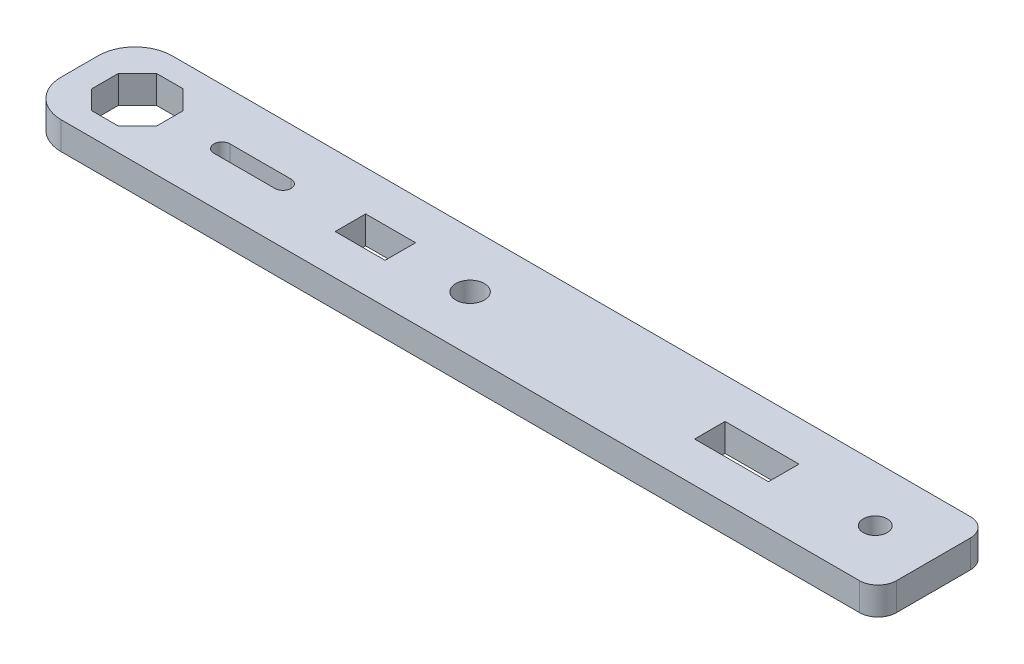
ISO-10303-21;
HEADER;
FILE_DESCRIPTION(('STEP AP214'),'2;1');
FILE_NAME('part.step','',(''),(''),'','','');
FILE_SCHEMA(('AUTOMOTIVE_DESIGN { 1 0 10303 214 1 1 1 1 }'));
ENDSEC;
DATA;
#1=APPLICATION_CONTEXT('core data for automotive mechanical design processes');
#2=APPLICATION_PROTOCOL_DEFINITION('international standard','automotive_design',2000,#1);
#3=PRODUCT_CONTEXT('',#1,'mechanical');
#4=PRODUCT('Part','Part','',(#3));
#5=PRODUCT_RELATED_PRODUCT_CATEGORY('part','',(#4));
#6=PRODUCT_DEFINITION_FORMATION('','',#4);
#7=PRODUCT_DEFINITION_CONTEXT('part definition',#1,'design');
#8=PRODUCT_DEFINITION('design','',#6,#7);
#9=PRODUCT_DEFINITION_SHAPE('','',#8);
#10=(LENGTH_UNIT() NAMED_UNIT(*) SI_UNIT(.MILLI.,.METRE.));
#11=(NAMED_UNIT(*) PLANE_ANGLE_UNIT() SI_UNIT($,.RADIAN.));
#12=(NAMED_UNIT(*) SI_UNIT($,.STERADIAN.) SOLID_ANGLE_UNIT());
#13=UNCERTAINTY_MEASURE_WITH_UNIT(LENGTH_MEASURE(1.E-05),#10,'distance_accuracy_value','');
#14=(GEOMETRIC_REPRESENTATION_CONTEXT(3) GLOBAL_UNCERTAINTY_ASSIGNED_CONTEXT((#13)) GLOBAL_UNIT_ASSIGNED_CONTEXT((#10,
#11,#12)) REPRESENTATION_CONTEXT('',''));
#15=CARTESIAN_POINT('',(0.,0.,0.));
#16=DIRECTION('',(0.,0.,1.));
#17=DIRECTION('',(1.,0.,0.));
#18=AXIS2_PLACEMENT_3D('',#15,#16,#17);
#19=CARTESIAN_POINT('',(0.,3.,0.));
#20=DIRECTION('',(1.,0.,0.));
#21=DIRECTION('',(0.,0.,-1.));
#22=AXIS2_PLACEMENT_3D('',#19,#20,#21);
#23=PLANE('',#22);
#24=DIRECTION('',(0.,0.,1.));
#25=VECTOR('',#24,1.);
#26=CARTESIAN_POINT('',(0.,3.,0.));
#27=LINE('',#26,#25);
#28=CARTESIAN_POINT('',(0.,3.,-8.));
#29=VERTEX_POINT('',#28);
#30=CARTESIAN_POINT('',(0.,3.,-4.));
#31=VERTEX_POINT('',#30);
#32=EDGE_CURVE('E397',#29,#31,#27,.T.);
#33=ORIENTED_EDGE('',*,*,#32,.F.);
#34=DIRECTION('',(0.,-1.,0.));
#35=VECTOR('',#34,1.);
#36=CARTESIAN_POINT('',(0.,3.,-8.));
#37=LINE('',#36,#35);
#38=CARTESIAN_POINT('',(0.,0.,-8.));
#39=VERTEX_POINT('',#38);
#40=EDGE_CURVE('E420',#29,#39,#37,.T.);
#41=ORIENTED_EDGE('',*,*,#40,.T.);
#42=DIRECTION('',(0.,0.,1.));
#43=VECTOR('',#42,1.);
#44=CARTESIAN_POINT('',(0.,0.,0.));
#45=LINE('',#44,#43);
#46=CARTESIAN_POINT('',(0.,0.,-4.));
#47=VERTEX_POINT('',#46);
#48=EDGE_CURVE('E331',#39,#47,#45,.T.);
#49=ORIENTED_EDGE('',*,*,#48,.T.);
#50=DIRECTION('',(0.,-1.,0.));
#51=VECTOR('',#50,1.);
#52=CARTESIAN_POINT('',(0.,3.,-4.));
#53=LINE('',#52,#51);
#54=EDGE_CURVE('E409',#47,#31,#53,.F.);
#55=ORIENTED_EDGE('',*,*,#54,.T.);
#56=EDGE_LOOP('',(#33,#41,#49,#55));
#57=FACE_BOUND('',#56,.T.);
#58=ADVANCED_FACE('F33',(#57),#23,.F.);
#59=CARTESIAN_POINT('',(0.,3.,0.));
#60=DIRECTION('',(0.,0.,-1.));
#61=DIRECTION('',(-1.,0.,0.));
#62=AXIS2_PLACEMENT_3D('',#59,#60,#61);
#63=PLANE('',#62);
#64=DIRECTION('',(1.,0.,0.));
#65=VECTOR('',#64,1.);
#66=CARTESIAN_POINT('',(0.,0.,0.));
#67=LINE('',#66,#65);
#68=CARTESIAN_POINT('',(4.,0.,0.));
#69=VERTEX_POINT('',#68);
#70=CARTESIAN_POINT('',(90.4,0.,0.));
#71=VERTEX_POINT('',#70);
#72=EDGE_CURVE('E412',#69,#71,#67,.T.);
#73=ORIENTED_EDGE('',*,*,#72,.T.);
#74=DIRECTION('',(0.,-1.,0.));
#75=VECTOR('',#74,1.);
#76=CARTESIAN_POINT('',(90.4,3.,0.));
#77=LINE('',#76,#75);
#78=CARTESIAN_POINT('',(90.4,3.,0.));
#79=VERTEX_POINT('',#78);
#80=EDGE_CURVE('E11',#71,#79,#77,.F.);
#81=ORIENTED_EDGE('',*,*,#80,.T.);
#82=DIRECTION('',(1.,0.,0.));
#83=VECTOR('',#82,1.);
#84=CARTESIAN_POINT('',(0.,3.,0.));
#85=LINE('',#84,#83);
#86=CARTESIAN_POINT('',(4.,3.,0.));
#87=VERTEX_POINT('',#86);
#88=EDGE_CURVE('E400',#87,#79,#85,.T.);
#89=ORIENTED_EDGE('',*,*,#88,.F.);
#90=DIRECTION('',(0.,-1.,0.));
#91=VECTOR('',#90,1.);
#92=CARTESIAN_POINT('',(4.,3.,0.));
#93=LINE('',#92,#91);
#94=EDGE_CURVE('E435',#87,#69,#93,.T.);
#95=ORIENTED_EDGE('',*,*,#94,.T.);
#96=EDGE_LOOP('',(#73,#81,#89,#95));
#97=FACE_BOUND('',#96,.T.);
#98=ADVANCED_FACE('F475',(#97),#63,.F.);
#99=CARTESIAN_POINT('',(92.4,3.,0.));
#100=DIRECTION('',(-1.,0.,0.));
#101=DIRECTION('',(0.,0.,1.));
#102=AXIS2_PLACEMENT_3D('',#99,#100,#101);
#103=PLANE('',#102);
#104=DIRECTION('',(0.,0.,-1.));
#105=VECTOR('',#104,1.);
#106=CARTESIAN_POINT('',(92.4,0.,0.));
#107=LINE('',#106,#105);
#108=CARTESIAN_POINT('',(92.4,0.,-2.));
#109=VERTEX_POINT('',#108);
#110=CARTESIAN_POINT('',(92.4,0.,-10.));
#111=VERTEX_POINT('',#110);
#112=EDGE_CURVE('E415',#109,#111,#107,.T.);
#113=ORIENTED_EDGE('',*,*,#112,.T.);
#114=DIRECTION('',(0.,-1.,0.));
#115=VECTOR('',#114,1.);
#116=CARTESIAN_POINT('',(92.4,3.,-10.));
#117=LINE('',#116,#115);
#118=CARTESIAN_POINT('',(92.4,3.,-10.));
#119=VERTEX_POINT('',#118);
#120=EDGE_CURVE('E448',#111,#119,#117,.F.);
#121=ORIENTED_EDGE('',*,*,#120,.T.);
#122=DIRECTION('',(0.,0.,-1.));
#123=VECTOR('',#122,1.);
#124=CARTESIAN_POINT('',(92.4,3.,0.));
#125=LINE('',#124,#123);
#126=CARTESIAN_POINT('',(92.4,3.,-2.));
#127=VERTEX_POINT('',#126);
#128=EDGE_CURVE('E404',#127,#119,#125,.T.);
#129=ORIENTED_EDGE('',*,*,#128,.F.);
#130=DIRECTION('',(0.,-1.,0.));
#131=VECTOR('',#130,1.);
#132=CARTESIAN_POINT('',(92.4,3.,-2.));
#133=LINE('',#132,#131);
#134=EDGE_CURVE('E445',#127,#109,#133,.T.);
#135=ORIENTED_EDGE('',*,*,#134,.T.);
#136=EDGE_LOOP('',(#113,#121,#129,#135));
#137=FACE_BOUND('',#136,.T.);
#138=ADVANCED_FACE('F468',(#137),#103,.F.);
#139=CARTESIAN_POINT('',(0.,3.,-12.));
#140=DIRECTION('',(0.,0.,1.));
#141=DIRECTION('',(1.,0.,0.));
#142=AXIS2_PLACEMENT_3D('',#139,#140,#141);
#143=PLANE('',#142);
#144=DIRECTION('',(-1.,0.,0.));
#145=VECTOR('',#144,1.);
#146=CARTESIAN_POINT('',(0.,3.,-12.));
#147=LINE('',#146,#145);
#148=CARTESIAN_POINT('',(90.4,3.,-12.));
#149=VERTEX_POINT('',#148);
#150=CARTESIAN_POINT('',(4.,3.,-12.));
#151=VERTEX_POINT('',#150);
#152=EDGE_CURVE('E407',#149,#151,#147,.T.);
#153=ORIENTED_EDGE('',*,*,#152,.F.);
#154=DIRECTION('',(0.,-1.,0.));
#155=VECTOR('',#154,1.);
#156=CARTESIAN_POINT('',(90.4,3.,-12.));
#157=LINE('',#156,#155);
#158=CARTESIAN_POINT('',(90.4,0.,-12.));
#159=VERTEX_POINT('',#158);
#160=EDGE_CURVE('E438',#149,#159,#157,.T.);
#161=ORIENTED_EDGE('',*,*,#160,.T.);
#162=DIRECTION('',(-1.,0.,0.));
#163=VECTOR('',#162,1.);
#164=CARTESIAN_POINT('',(0.,0.,-12.));
#165=LINE('',#164,#163);
#166=CARTESIAN_POINT('',(4.,0.,-12.));
#167=VERTEX_POINT('',#166);
#168=EDGE_CURVE('E401',#159,#167,#165,.T.);
#169=ORIENTED_EDGE('',*,*,#168,.T.);
#170=DIRECTION('',(0.,-1.,0.));
#171=VECTOR('',#170,1.);
#172=CARTESIAN_POINT('',(4.,3.,-12.));
#173=LINE('',#172,#171);
#174=EDGE_CURVE('E428',#167,#151,#173,.F.);
#175=ORIENTED_EDGE('',*,*,#174,.T.);
#176=EDGE_LOOP('',(#153,#161,#169,#175));
#177=FACE_BOUND('',#176,.T.);
#178=ADVANCED_FACE('F460',(#177),#143,.F.);
#179=CARTESIAN_POINT('',(0.,3.,0.));
#180=DIRECTION('',(0.,-1.,0.));
#181=DIRECTION('',(0.,0.,-1.));
#182=AXIS2_PLACEMENT_3D('',#179,#180,#181);
#183=PLANE('',#182);
#184=DIRECTION('',(-0.707106781186548,0.,-0.707106781186547));
#185=VECTOR('',#184,1.);
#186=CARTESIAN_POINT('',(9.75,3.,-7.44974746830583));
#187=LINE('',#186,#185);
#188=CARTESIAN_POINT('',(9.75,3.,-7.44974746830583));
#189=VERTEX_POINT('',#188);
#190=CARTESIAN_POINT('',(7.69974746830583,3.,-9.5));
#191=VERTEX_POINT('',#190);
#192=EDGE_CURVE('E308',#189,#191,#187,.T.);
#193=ORIENTED_EDGE('',*,*,#192,.F.);
#194=DIRECTION('',(0.,0.,-1.));
#195=VECTOR('',#194,1.);
#196=CARTESIAN_POINT('',(9.75,3.,-4.55025253169416));
#197=LINE('',#196,#195);
#198=CARTESIAN_POINT('',(9.75,3.,-4.55025253169416));
#199=VERTEX_POINT('',#198);
#200=EDGE_CURVE('E48',#199,#189,#197,.T.);
#201=ORIENTED_EDGE('',*,*,#200,.F.);
#202=DIRECTION('',(0.707106781186547,0.,-0.707106781186547));
#203=VECTOR('',#202,1.);
#204=CARTESIAN_POINT('',(7.69974746830583,3.,-2.5));
#205=LINE('',#204,#203);
#206=CARTESIAN_POINT('',(7.69974746830583,3.,-2.5));
#207=VERTEX_POINT('',#206);
#208=EDGE_CURVE('E285',#207,#199,#205,.T.);
#209=ORIENTED_EDGE('',*,*,#208,.F.);
#210=DIRECTION('',(1.,0.,0.));
#211=VECTOR('',#210,1.);
#212=CARTESIAN_POINT('',(4.80025253169417,3.,-2.5));
#213=LINE('',#212,#211);
#214=CARTESIAN_POINT('',(4.80025253169417,3.,-2.5));
#215=VERTEX_POINT('',#214);
#216=EDGE_CURVE('E324',#215,#207,#213,.T.);
#217=ORIENTED_EDGE('',*,*,#216,.F.);
#218=DIRECTION('',(0.707106781186548,0.,0.707106781186547));
#219=VECTOR('',#218,1.);
#220=CARTESIAN_POINT('',(2.75,3.,-4.55025253169416));
#221=LINE('',#220,#219);
#222=CARTESIAN_POINT('',(2.75,3.,-4.55025253169416));
#223=VERTEX_POINT('',#222);
#224=EDGE_CURVE('E321',#223,#215,#221,.T.);
#225=ORIENTED_EDGE('',*,*,#224,.F.);
#226=DIRECTION('',(0.,0.,1.));
#227=VECTOR('',#226,1.);
#228=CARTESIAN_POINT('',(2.75,3.,-7.44974746830583));
#229=LINE('',#228,#227);
#230=CARTESIAN_POINT('',(2.75,3.,-7.44974746830583));
#231=VERTEX_POINT('',#230);
#232=EDGE_CURVE('E318',#231,#223,#229,.T.);
#233=ORIENTED_EDGE('',*,*,#232,.F.);
#234=DIRECTION('',(-0.707106781186547,0.,0.707106781186548));
#235=VECTOR('',#234,1.);
#236=CARTESIAN_POINT('',(4.80025253169417,3.,-9.5));
#237=LINE('',#236,#235);
#238=CARTESIAN_POINT('',(4.80025253169417,3.,-9.5));
#239=VERTEX_POINT('',#238);
#240=EDGE_CURVE('E315',#239,#231,#237,.T.);
#241=ORIENTED_EDGE('',*,*,#240,.F.);
#242=DIRECTION('',(-1.,0.,0.));
#243=VECTOR('',#242,1.);
#244=CARTESIAN_POINT('',(7.69974746830583,3.,-9.5));
#245=LINE('',#244,#243);
#246=EDGE_CURVE('E312',#191,#239,#245,.T.);
#247=ORIENTED_EDGE('',*,*,#246,.F.);
#248=EDGE_LOOP('',(#193,#201,#209,#217,#225,#233,#241,#247));
#249=FACE_BOUND('',#248,.T.);
#250=DIRECTION('',(-1.,0.,0.));
#251=VECTOR('',#250,1.);
#252=CARTESIAN_POINT('',(76.2,3.,-7.65));
#253=LINE('',#252,#251);
#254=CARTESIAN_POINT('',(76.2,3.,-7.65));
#255=VERTEX_POINT('',#254);
#256=CARTESIAN_POINT('',(68.2,3.,-7.65));
#257=VERTEX_POINT('',#256);
#258=EDGE_CURVE('E247',#255,#257,#253,.T.);
#259=ORIENTED_EDGE('',*,*,#258,.F.);
#260=DIRECTION('',(0.,0.,-1.));
#261=VECTOR('',#260,1.);
#262=CARTESIAN_POINT('',(76.2,3.,-7.5));
#263=LINE('',#262,#261);
#264=CARTESIAN_POINT('',(76.2,3.,-4.35));
#265=VERTEX_POINT('',#264);
#266=EDGE_CURVE('E229',#265,#255,#263,.T.);
#267=ORIENTED_EDGE('',*,*,#266,.F.);
#268=DIRECTION('',(1.,0.,0.));
#269=VECTOR('',#268,1.);
#270=CARTESIAN_POINT('',(76.2,3.,-4.35));
#271=LINE('',#270,#269);
#272=CARTESIAN_POINT('',(68.2,3.,-4.35));
#273=VERTEX_POINT('',#272);
#274=EDGE_CURVE('E243',#273,#265,#271,.T.);
#275=ORIENTED_EDGE('',*,*,#274,.F.);
#276=DIRECTION('',(0.,0.,1.));
#277=VECTOR('',#276,1.);
#278=CARTESIAN_POINT('',(68.2,3.,-7.5));
#279=LINE('',#278,#277);
#280=EDGE_CURVE('E234',#257,#273,#279,.T.);
#281=ORIENTED_EDGE('',*,*,#280,.F.);
#282=EDGE_LOOP('',(#259,#267,#275,#281));
#283=FACE_BOUND('',#282,.T.);
#284=CARTESIAN_POINT('',(86.1,3.,-6.));
#285=DIRECTION('',(0.,1.,0.));
#286=DIRECTION('',(0.,0.,1.));
#287=AXIS2_PLACEMENT_3D('',#284,#285,#286);
#288=CIRCLE('',#287,1.29999999999999);
#289=CARTESIAN_POINT('',(86.1,3.,-4.70000000000001));
#290=VERTEX_POINT('',#289);
#291=EDGE_CURVE('E346',#290,#290,#288,.T.);
#292=ORIENTED_EDGE('',*,*,#291,.F.);
#293=EDGE_LOOP('',(#292));
#294=FACE_BOUND('',#293,.T.);
#295=CARTESIAN_POINT('',(42.25,3.,-6.));
#296=DIRECTION('',(0.,1.,0.));
#297=DIRECTION('',(0.,0.,1.));
#298=AXIS2_PLACEMENT_3D('',#295,#296,#297);
#299=CIRCLE('',#298,1.55);
#300=CARTESIAN_POINT('',(42.25,3.,-4.45));
#301=VERTEX_POINT('',#300);
#302=EDGE_CURVE('E389',#301,#301,#299,.T.);
#303=ORIENTED_EDGE('',*,*,#302,.F.);
#304=EDGE_LOOP('',(#303));
#305=FACE_BOUND('',#304,.T.);
#306=DIRECTION('',(1.,0.,0.));
#307=VECTOR('',#306,1.);
#308=CARTESIAN_POINT('',(29.3,3.,-4.34999999999999));
#309=LINE('',#308,#307);
#310=CARTESIAN_POINT('',(29.3,3.,-4.34999999999999));
#311=VERTEX_POINT('',#310);
#312=CARTESIAN_POINT('',(34.7,3.,-4.34999999999999));
#313=VERTEX_POINT('',#312);
#314=EDGE_CURVE('E253',#311,#313,#309,.T.);
#315=ORIENTED_EDGE('',*,*,#314,.F.);
#316=DIRECTION('',(0.,0.,1.));
#317=VECTOR('',#316,1.);
#318=CARTESIAN_POINT('',(29.3,3.,-7.5));
#319=LINE('',#318,#317);
#320=CARTESIAN_POINT('',(29.3,3.,-7.65));
#321=VERTEX_POINT('',#320);
#322=EDGE_CURVE('E383',#321,#311,#319,.T.);
#323=ORIENTED_EDGE('',*,*,#322,.F.);
#324=DIRECTION('',(-1.,0.,0.));
#325=VECTOR('',#324,1.);
#326=CARTESIAN_POINT('',(29.3,3.,-7.65));
#327=LINE('',#326,#325);
#328=CARTESIAN_POINT('',(34.7,3.,-7.65));
#329=VERTEX_POINT('',#328);
#330=EDGE_CURVE('E260',#329,#321,#327,.T.);
#331=ORIENTED_EDGE('',*,*,#330,.F.);
#332=DIRECTION('',(0.,0.,-1.));
#333=VECTOR('',#332,1.);
#334=CARTESIAN_POINT('',(34.7,3.,-7.5));
#335=LINE('',#334,#333);
#336=EDGE_CURVE('E381',#313,#329,#335,.T.);
#337=ORIENTED_EDGE('',*,*,#336,.F.);
#338=EDGE_LOOP('',(#315,#323,#331,#337));
#339=FACE_BOUND('',#338,.T.);
#340=DIRECTION('',(1.,0.,0.));
#341=VECTOR('',#340,1.);
#342=CARTESIAN_POINT('',(15.4,3.,-5.125));
#343=LINE('',#342,#341);
#344=CARTESIAN_POINT('',(15.4,3.,-5.125));
#345=VERTEX_POINT('',#344);
#346=CARTESIAN_POINT('',(22.,3.,-5.125));
#347=VERTEX_POINT('',#346);
#348=EDGE_CURVE('E364',#345,#347,#343,.T.);
#349=ORIENTED_EDGE('',*,*,#348,.F.);
#350=CARTESIAN_POINT('',(15.4,3.,-6.));
#351=DIRECTION('',(0.,1.,0.));
#352=DIRECTION('',(0.,0.,1.));
#353=AXIS2_PLACEMENT_3D('',#350,#351,#352);
#354=CIRCLE('',#353,0.875);
#355=CARTESIAN_POINT('',(15.4,3.,-6.875));
#356=VERTEX_POINT('',#355);
#357=EDGE_CURVE('E56',#356,#345,#354,.T.);
#358=ORIENTED_EDGE('',*,*,#357,.F.);
#359=DIRECTION('',(-1.,0.,0.));
#360=VECTOR('',#359,1.);
#361=CARTESIAN_POINT('',(15.4,3.,-6.875));
#362=LINE('',#361,#360);
#363=CARTESIAN_POINT('',(22.,3.,-6.875));
#364=VERTEX_POINT('',#363);
#365=EDGE_CURVE('E353',#364,#356,#362,.T.);
#366=ORIENTED_EDGE('',*,*,#365,.F.);
#367=CARTESIAN_POINT('',(22.,3.,-6.));
#368=DIRECTION('',(0.,1.,0.));
#369=DIRECTION('',(0.,0.,1.));
#370=AXIS2_PLACEMENT_3D('',#367,#368,#369);
#371=CIRCLE('',#370,0.875);
#372=EDGE_CURVE('E368',#347,#364,#371,.T.);
#373=ORIENTED_EDGE('',*,*,#372,.F.);
#374=EDGE_LOOP('',(#349,#358,#366,#373));
#375=FACE_BOUND('',#374,.T.);
#376=ORIENTED_EDGE('',*,*,#128,.T.);
#377=CARTESIAN_POINT('',(90.4,3.,-10.));
#378=DIRECTION('',(0.,-1.,0.));
#379=DIRECTION('',(0.,0.,-1.));
#380=AXIS2_PLACEMENT_3D('',#377,#378,#379);
#381=CIRCLE('',#380,2.);
#382=EDGE_CURVE('E41',#119,#149,#381,.F.);
#383=ORIENTED_EDGE('',*,*,#382,.T.);
#384=ORIENTED_EDGE('',*,*,#152,.T.);
#385=CARTESIAN_POINT('',(4.,3.,-8.));
#386=DIRECTION('',(0.,-1.,0.));
#387=DIRECTION('',(0.,0.,-1.));
#388=AXIS2_PLACEMENT_3D('',#385,#386,#387);
#389=CIRCLE('',#388,4.);
#390=EDGE_CURVE('E433',#151,#29,#389,.F.);
#391=ORIENTED_EDGE('',*,*,#390,.T.);
#392=ORIENTED_EDGE('',*,*,#32,.T.);
#393=CARTESIAN_POINT('',(4.,3.,-4.));
#394=DIRECTION('',(0.,-1.,0.));
#395=DIRECTION('',(0.,0.,-1.));
#396=AXIS2_PLACEMENT_3D('',#393,#394,#395);
#397=CIRCLE('',#396,4.);
#398=EDGE_CURVE('E431',#31,#87,#397,.F.);
#399=ORIENTED_EDGE('',*,*,#398,.T.);
#400=ORIENTED_EDGE('',*,*,#88,.T.);
#401=CARTESIAN_POINT('',(90.4,3.,-2.));
#402=DIRECTION('',(0.,-1.,0.));
#403=DIRECTION('',(0.,0.,-1.));
#404=AXIS2_PLACEMENT_3D('',#401,#402,#403);
#405=CIRCLE('',#404,2.);
#406=EDGE_CURVE('E450',#79,#127,#405,.F.);
#407=ORIENTED_EDGE('',*,*,#406,.T.);
#408=EDGE_LOOP('',(#376,#383,#384,#391,#392,#399,#400,#407));
#409=FACE_BOUND('',#408,.T.);
#410=ADVANCED_FACE('F454',(#249,#283,#294,#305,#339,#375,#409),#183,.F.);
#411=CARTESIAN_POINT('',(0.,0.,0.));
#412=DIRECTION('',(0.,-1.,0.));
#413=DIRECTION('',(0.,0.,-1.));
#414=AXIS2_PLACEMENT_3D('',#411,#412,#413);
#415=PLANE('',#414);
#416=DIRECTION('',(0.,0.,1.));
#417=VECTOR('',#416,1.);
#418=CARTESIAN_POINT('',(29.3,0.,-7.5));
#419=LINE('',#418,#417);
#420=CARTESIAN_POINT('',(29.3,0.,-7.65));
#421=VERTEX_POINT('',#420);
#422=CARTESIAN_POINT('',(29.3,0.,-4.34999999999999));
#423=VERTEX_POINT('',#422);
#424=EDGE_CURVE('E379',#421,#423,#419,.T.);
#425=ORIENTED_EDGE('',*,*,#424,.T.);
#426=DIRECTION('',(1.,0.,0.));
#427=VECTOR('',#426,1.);
#428=CARTESIAN_POINT('',(29.3,0.,-4.34999999999999));
#429=LINE('',#428,#427);
#430=CARTESIAN_POINT('',(34.7,0.,-4.34999999999999));
#431=VERTEX_POINT('',#430);
#432=EDGE_CURVE('E249',#423,#431,#429,.T.);
#433=ORIENTED_EDGE('',*,*,#432,.T.);
#434=DIRECTION('',(0.,0.,-1.));
#435=VECTOR('',#434,1.);
#436=CARTESIAN_POINT('',(34.7,0.,-7.5));
#437=LINE('',#436,#435);
#438=CARTESIAN_POINT('',(34.7,0.,-7.65));
#439=VERTEX_POINT('',#438);
#440=EDGE_CURVE('E365',#431,#439,#437,.T.);
#441=ORIENTED_EDGE('',*,*,#440,.T.);
#442=DIRECTION('',(-1.,0.,0.));
#443=VECTOR('',#442,1.);
#444=CARTESIAN_POINT('',(29.3,0.,-7.65));
#445=LINE('',#444,#443);
#446=EDGE_CURVE('E270',#439,#421,#445,.T.);
#447=ORIENTED_EDGE('',*,*,#446,.T.);
#448=EDGE_LOOP('',(#425,#433,#441,#447));
#449=FACE_BOUND('',#448,.T.);
#450=DIRECTION('',(0.,0.,-1.));
#451=VECTOR('',#450,1.);
#452=CARTESIAN_POINT('',(76.2,0.,-7.5));
#453=LINE('',#452,#451);
#454=CARTESIAN_POINT('',(76.2,0.,-4.35));
#455=VERTEX_POINT('',#454);
#456=CARTESIAN_POINT('',(76.2,0.,-7.65));
#457=VERTEX_POINT('',#456);
#458=EDGE_CURVE('E228',#455,#457,#453,.T.);
#459=ORIENTED_EDGE('',*,*,#458,.T.);
#460=DIRECTION('',(-1.,0.,0.));
#461=VECTOR('',#460,1.);
#462=CARTESIAN_POINT('',(76.2,0.,-7.65));
#463=LINE('',#462,#461);
#464=CARTESIAN_POINT('',(68.2,0.,-7.65));
#465=VERTEX_POINT('',#464);
#466=EDGE_CURVE('E224',#457,#465,#463,.T.);
#467=ORIENTED_EDGE('',*,*,#466,.T.);
#468=DIRECTION('',(0.,0.,1.));
#469=VECTOR('',#468,1.);
#470=CARTESIAN_POINT('',(68.2,0.,-7.5));
#471=LINE('',#470,#469);
#472=CARTESIAN_POINT('',(68.2,0.,-4.35));
#473=VERTEX_POINT('',#472);
#474=EDGE_CURVE('E217',#465,#473,#471,.T.);
#475=ORIENTED_EDGE('',*,*,#474,.T.);
#476=DIRECTION('',(1.,0.,0.));
#477=VECTOR('',#476,1.);
#478=CARTESIAN_POINT('',(76.2,0.,-4.35));
#479=LINE('',#478,#477);
#480=EDGE_CURVE('E222',#473,#455,#479,.T.);
#481=ORIENTED_EDGE('',*,*,#480,.T.);
#482=EDGE_LOOP('',(#459,#467,#475,#481));
#483=FACE_BOUND('',#482,.T.);
#484=DIRECTION('',(0.,0.,-1.));
#485=VECTOR('',#484,1.);
#486=CARTESIAN_POINT('',(9.75,0.,-4.55025253169416));
#487=LINE('',#486,#485);
#488=CARTESIAN_POINT('',(9.75,0.,-4.55025253169416));
#489=VERTEX_POINT('',#488);
#490=CARTESIAN_POINT('',(9.75,0.,-7.44974746830583));
#491=VERTEX_POINT('',#490);
#492=EDGE_CURVE('E281',#489,#491,#487,.T.);
#493=ORIENTED_EDGE('',*,*,#492,.T.);
#494=DIRECTION('',(-0.707106781186548,0.,-0.707106781186547));
#495=VECTOR('',#494,1.);
#496=CARTESIAN_POINT('',(9.75,0.,-7.44974746830583));
#497=LINE('',#496,#495);
#498=CARTESIAN_POINT('',(7.69974746830583,0.,-9.5));
#499=VERTEX_POINT('',#498);
#500=EDGE_CURVE('E284',#491,#499,#497,.T.);
#501=ORIENTED_EDGE('',*,*,#500,.T.);
#502=DIRECTION('',(-1.,0.,0.));
#503=VECTOR('',#502,1.);
#504=CARTESIAN_POINT('',(7.69974746830583,0.,-9.5));
#505=LINE('',#504,#503);
#506=CARTESIAN_POINT('',(4.80025253169417,0.,-9.5));
#507=VERTEX_POINT('',#506);
#508=EDGE_CURVE('E288',#499,#507,#505,.T.);
#509=ORIENTED_EDGE('',*,*,#508,.T.);
#510=DIRECTION('',(-0.707106781186547,0.,0.707106781186548));
#511=VECTOR('',#510,1.);
#512=CARTESIAN_POINT('',(4.80025253169417,0.,-9.5));
#513=LINE('',#512,#511);
#514=CARTESIAN_POINT('',(2.75,0.,-7.44974746830583));
#515=VERTEX_POINT('',#514);
#516=EDGE_CURVE('E291',#507,#515,#513,.T.);
#517=ORIENTED_EDGE('',*,*,#516,.T.);
#518=DIRECTION('',(0.,0.,1.));
#519=VECTOR('',#518,1.);
#520=CARTESIAN_POINT('',(2.75,0.,-7.44974746830583));
#521=LINE('',#520,#519);
#522=CARTESIAN_POINT('',(2.75,0.,-4.55025253169416));
#523=VERTEX_POINT('',#522);
#524=EDGE_CURVE('E294',#515,#523,#521,.T.);
#525=ORIENTED_EDGE('',*,*,#524,.T.);
#526=DIRECTION('',(0.707106781186548,0.,0.707106781186547));
#527=VECTOR('',#526,1.);
#528=CARTESIAN_POINT('',(2.75,0.,-4.55025253169416));
#529=LINE('',#528,#527);
#530=CARTESIAN_POINT('',(4.80025253169417,0.,-2.5));
#531=VERTEX_POINT('',#530);
#532=EDGE_CURVE('E297',#523,#531,#529,.T.);
#533=ORIENTED_EDGE('',*,*,#532,.T.);
#534=DIRECTION('',(1.,0.,0.));
#535=VECTOR('',#534,1.);
#536=CARTESIAN_POINT('',(4.80025253169417,0.,-2.5));
#537=LINE('',#536,#535);
#538=CARTESIAN_POINT('',(7.69974746830583,0.,-2.5));
#539=VERTEX_POINT('',#538);
#540=EDGE_CURVE('E300',#531,#539,#537,.T.);
#541=ORIENTED_EDGE('',*,*,#540,.T.);
#542=DIRECTION('',(0.707106781186547,0.,-0.707106781186547));
#543=VECTOR('',#542,1.);
#544=CARTESIAN_POINT('',(7.69974746830583,0.,-2.5));
#545=LINE('',#544,#543);
#546=EDGE_CURVE('E303',#539,#489,#545,.T.);
#547=ORIENTED_EDGE('',*,*,#546,.T.);
#548=EDGE_LOOP('',(#493,#501,#509,#517,#525,#533,#541,#547));
#549=FACE_BOUND('',#548,.T.);
#550=CARTESIAN_POINT('',(86.1,0.,-6.));
#551=DIRECTION('',(0.,1.,0.));
#552=DIRECTION('',(0.,0.,1.));
#553=AXIS2_PLACEMENT_3D('',#550,#551,#552);
#554=CIRCLE('',#553,1.29999999999999);
#555=CARTESIAN_POINT('',(86.1,0.,-4.70000000000001));
#556=VERTEX_POINT('',#555);
#557=EDGE_CURVE('E392',#556,#556,#554,.T.);
#558=ORIENTED_EDGE('',*,*,#557,.T.);
#559=EDGE_LOOP('',(#558));
#560=FACE_BOUND('',#559,.T.);
#561=CARTESIAN_POINT('',(42.25,0.,-6.));
#562=DIRECTION('',(0.,1.,0.));
#563=DIRECTION('',(0.,0.,1.));
#564=AXIS2_PLACEMENT_3D('',#561,#562,#563);
#565=CIRCLE('',#564,1.55);
#566=CARTESIAN_POINT('',(42.25,0.,-4.45));
#567=VERTEX_POINT('',#566);
#568=EDGE_CURVE('E385',#567,#567,#565,.T.);
#569=ORIENTED_EDGE('',*,*,#568,.T.);
#570=EDGE_LOOP('',(#569));
#571=FACE_BOUND('',#570,.T.);
#572=CARTESIAN_POINT('',(15.4,0.,-6.));
#573=DIRECTION('',(0.,1.,0.));
#574=DIRECTION('',(0.,0.,1.));
#575=AXIS2_PLACEMENT_3D('',#572,#573,#574);
#576=CIRCLE('',#575,0.875);
#577=CARTESIAN_POINT('',(15.4,0.,-6.875));
#578=VERTEX_POINT('',#577);
#579=CARTESIAN_POINT('',(15.4,0.,-5.125));
#580=VERTEX_POINT('',#579);
#581=EDGE_CURVE('E349',#578,#580,#576,.T.);
#582=ORIENTED_EDGE('',*,*,#581,.T.);
#583=DIRECTION('',(1.,0.,0.));
#584=VECTOR('',#583,1.);
#585=CARTESIAN_POINT('',(15.4,0.,-5.125));
#586=LINE('',#585,#584);
#587=CARTESIAN_POINT('',(22.,0.,-5.125));
#588=VERTEX_POINT('',#587);
#589=EDGE_CURVE('E352',#580,#588,#586,.T.);
#590=ORIENTED_EDGE('',*,*,#589,.T.);
#591=CARTESIAN_POINT('',(22.,0.,-6.));
#592=DIRECTION('',(0.,1.,0.));
#593=DIRECTION('',(0.,0.,1.));
#594=AXIS2_PLACEMENT_3D('',#591,#592,#593);
#595=CIRCLE('',#594,0.875);
#596=CARTESIAN_POINT('',(22.,0.,-6.875));
#597=VERTEX_POINT('',#596);
#598=EDGE_CURVE('E356',#588,#597,#595,.T.);
#599=ORIENTED_EDGE('',*,*,#598,.T.);
#600=DIRECTION('',(-1.,0.,0.));
#601=VECTOR('',#600,1.);
#602=CARTESIAN_POINT('',(15.4,0.,-6.875));
#603=LINE('',#602,#601);
#604=EDGE_CURVE('E359',#597,#578,#603,.T.);
#605=ORIENTED_EDGE('',*,*,#604,.T.);
#606=EDGE_LOOP('',(#582,#590,#599,#605));
#607=FACE_BOUND('',#606,.T.);
#608=ORIENTED_EDGE('',*,*,#168,.F.);
#609=CARTESIAN_POINT('',(90.4,0.,-10.));
#610=DIRECTION('',(0.,-1.,0.));
#611=DIRECTION('',(0.,0.,-1.));
#612=AXIS2_PLACEMENT_3D('',#609,#610,#611);
#613=CIRCLE('',#612,2.);
#614=EDGE_CURVE('E443',#159,#111,#613,.T.);
#615=ORIENTED_EDGE('',*,*,#614,.T.);
#616=ORIENTED_EDGE('',*,*,#112,.F.);
#617=CARTESIAN_POINT('',(90.4,0.,-2.));
#618=DIRECTION('',(0.,-1.,0.));
#619=DIRECTION('',(0.,0.,-1.));
#620=AXIS2_PLACEMENT_3D('',#617,#618,#619);
#621=CIRCLE('',#620,2.);
#622=EDGE_CURVE('E441',#109,#71,#621,.T.);
#623=ORIENTED_EDGE('',*,*,#622,.T.);
#624=ORIENTED_EDGE('',*,*,#72,.F.);
#625=CARTESIAN_POINT('',(4.,0.,-4.));
#626=DIRECTION('',(0.,-1.,0.));
#627=DIRECTION('',(0.,0.,-1.));
#628=AXIS2_PLACEMENT_3D('',#625,#626,#627);
#629=CIRCLE('',#628,4.);
#630=EDGE_CURVE('E423',#69,#47,#629,.T.);
#631=ORIENTED_EDGE('',*,*,#630,.T.);
#632=ORIENTED_EDGE('',*,*,#48,.F.);
#633=CARTESIAN_POINT('',(4.,0.,-8.));
#634=DIRECTION('',(0.,-1.,0.));
#635=DIRECTION('',(0.,0.,-1.));
#636=AXIS2_PLACEMENT_3D('',#633,#634,#635);
#637=CIRCLE('',#636,4.);
#638=EDGE_CURVE('E425',#39,#167,#637,.T.);
#639=ORIENTED_EDGE('',*,*,#638,.T.);
#640=EDGE_LOOP('',(#608,#615,#616,#623,#624,#631,#632,#639));
#641=FACE_BOUND('',#640,.T.);
#642=ADVANCED_FACE('F219',(#449,#483,#549,#560,#571,#607,#641),#415,.T.);
#643=CARTESIAN_POINT('',(4.,3.,-8.));
#644=DIRECTION('',(0.,-1.,0.));
#645=DIRECTION('',(0.,0.,-1.));
#646=AXIS2_PLACEMENT_3D('',#643,#644,#645);
#647=CYLINDRICAL_SURFACE('',#646,4.);
#648=ORIENTED_EDGE('',*,*,#390,.F.);
#649=ORIENTED_EDGE('',*,*,#174,.F.);
#650=ORIENTED_EDGE('',*,*,#638,.F.);
#651=ORIENTED_EDGE('',*,*,#40,.F.);
#652=EDGE_LOOP('',(#648,#649,#650,#651));
#653=FACE_BOUND('',#652,.T.);
#654=ADVANCED_FACE('F487',(#653),#647,.T.);
#655=CARTESIAN_POINT('',(4.,3.,-4.));
#656=DIRECTION('',(0.,-1.,0.));
#657=DIRECTION('',(0.,0.,-1.));
#658=AXIS2_PLACEMENT_3D('',#655,#656,#657);
#659=CYLINDRICAL_SURFACE('',#658,4.);
#660=ORIENTED_EDGE('',*,*,#398,.F.);
#661=ORIENTED_EDGE('',*,*,#54,.F.);
#662=ORIENTED_EDGE('',*,*,#630,.F.);
#663=ORIENTED_EDGE('',*,*,#94,.F.);
#664=EDGE_LOOP('',(#660,#661,#662,#663));
#665=FACE_BOUND('',#664,.T.);
#666=ADVANCED_FACE('F480',(#665),#659,.T.);
#667=CARTESIAN_POINT('',(90.4,3.,-10.));
#668=DIRECTION('',(0.,-1.,0.));
#669=DIRECTION('',(0.,0.,-1.));
#670=AXIS2_PLACEMENT_3D('',#667,#668,#669);
#671=CYLINDRICAL_SURFACE('',#670,2.);
#672=ORIENTED_EDGE('',*,*,#382,.F.);
#673=ORIENTED_EDGE('',*,*,#120,.F.);
#674=ORIENTED_EDGE('',*,*,#614,.F.);
#675=ORIENTED_EDGE('',*,*,#160,.F.);
#676=EDGE_LOOP('',(#672,#673,#674,#675));
#677=FACE_BOUND('',#676,.T.);
#678=ADVANCED_FACE('F464',(#677),#671,.T.);
#679=CARTESIAN_POINT('',(90.4,3.,-2.));
#680=DIRECTION('',(0.,-1.,0.));
#681=DIRECTION('',(0.,0.,-1.));
#682=AXIS2_PLACEMENT_3D('',#679,#680,#681);
#683=CYLINDRICAL_SURFACE('',#682,2.);
#684=ORIENTED_EDGE('',*,*,#406,.F.);
#685=ORIENTED_EDGE('',*,*,#80,.F.);
#686=ORIENTED_EDGE('',*,*,#622,.F.);
#687=ORIENTED_EDGE('',*,*,#134,.F.);
#688=EDGE_LOOP('',(#684,#685,#686,#687));
#689=FACE_BOUND('',#688,.T.);
#690=ADVANCED_FACE('F35',(#689),#683,.T.);
#691=CARTESIAN_POINT('',(15.4,0.,-6.));
#692=DIRECTION('',(0.,1.,0.));
#693=DIRECTION('',(0.,0.,1.));
#694=AXIS2_PLACEMENT_3D('',#691,#692,#693);
#695=CYLINDRICAL_SURFACE('',#694,0.875);
#696=ORIENTED_EDGE('',*,*,#357,.T.);
#697=DIRECTION('',(0.,1.,0.));
#698=VECTOR('',#697,1.);
#699=CARTESIAN_POINT('',(15.4,0.,-5.125));
#700=LINE('',#699,#698);
#701=EDGE_CURVE('E362',#580,#345,#700,.T.);
#702=ORIENTED_EDGE('',*,*,#701,.F.);
#703=ORIENTED_EDGE('',*,*,#581,.F.);
#704=DIRECTION('',(0.,1.,0.));
#705=VECTOR('',#704,1.);
#706=CARTESIAN_POINT('',(15.4,0.,-6.875));
#707=LINE('',#706,#705);
#708=EDGE_CURVE('E309',#578,#356,#707,.T.);
#709=ORIENTED_EDGE('',*,*,#708,.T.);
#710=EDGE_LOOP('',(#696,#702,#703,#709));
#711=FACE_BOUND('',#710,.T.);
#712=ADVANCED_FACE('F528',(#711),#695,.F.);
#713=CARTESIAN_POINT('',(15.4,0.,-6.875));
#714=DIRECTION('',(0.,0.,-1.));
#715=DIRECTION('',(-1.,0.,0.));
#716=AXIS2_PLACEMENT_3D('',#713,#714,#715);
#717=PLANE('',#716);
#718=ORIENTED_EDGE('',*,*,#365,.T.);
#719=ORIENTED_EDGE('',*,*,#708,.F.);
#720=ORIENTED_EDGE('',*,*,#604,.F.);
#721=DIRECTION('',(0.,1.,0.));
#722=VECTOR('',#721,1.);
#723=CARTESIAN_POINT('',(22.,0.,-6.875));
#724=LINE('',#723,#722);
#725=EDGE_CURVE('E374',#597,#364,#724,.T.);
#726=ORIENTED_EDGE('',*,*,#725,.T.);
#727=EDGE_LOOP('',(#718,#719,#720,#726));
#728=FACE_BOUND('',#727,.T.);
#729=ADVANCED_FACE('F531',(#728),#717,.F.);
#730=CARTESIAN_POINT('',(22.,0.,-6.));
#731=DIRECTION('',(0.,1.,0.));
#732=DIRECTION('',(0.,0.,1.));
#733=AXIS2_PLACEMENT_3D('',#730,#731,#732);
#734=CYLINDRICAL_SURFACE('',#733,0.875);
#735=ORIENTED_EDGE('',*,*,#372,.T.);
#736=ORIENTED_EDGE('',*,*,#725,.F.);
#737=ORIENTED_EDGE('',*,*,#598,.F.);
#738=DIRECTION('',(0.,1.,0.));
#739=VECTOR('',#738,1.);
#740=CARTESIAN_POINT('',(22.,0.,-5.125));
#741=LINE('',#740,#739);
#742=EDGE_CURVE('E376',#588,#347,#741,.T.);
#743=ORIENTED_EDGE('',*,*,#742,.T.);
#744=EDGE_LOOP('',(#735,#736,#737,#743));
#745=FACE_BOUND('',#744,.T.);
#746=ADVANCED_FACE('F534',(#745),#734,.F.);
#747=CARTESIAN_POINT('',(15.4,0.,-5.125));
#748=DIRECTION('',(0.,0.,1.));
#749=DIRECTION('',(1.,0.,0.));
#750=AXIS2_PLACEMENT_3D('',#747,#748,#749);
#751=PLANE('',#750);
#752=ORIENTED_EDGE('',*,*,#348,.T.);
#753=ORIENTED_EDGE('',*,*,#742,.F.);
#754=ORIENTED_EDGE('',*,*,#589,.F.);
#755=ORIENTED_EDGE('',*,*,#701,.T.);
#756=EDGE_LOOP('',(#752,#753,#754,#755));
#757=FACE_BOUND('',#756,.T.);
#758=ADVANCED_FACE('F523',(#757),#751,.F.);
#759=CARTESIAN_POINT('',(29.3,0.,-7.5));
#760=DIRECTION('',(-1.,0.,0.));
#761=DIRECTION('',(0.,0.,1.));
#762=AXIS2_PLACEMENT_3D('',#759,#760,#761);
#763=PLANE('',#762);
#764=ORIENTED_EDGE('',*,*,#322,.T.);
#765=DIRECTION('',(0.,1.,0.));
#766=VECTOR('',#765,1.);
#767=CARTESIAN_POINT('',(29.3,0.,-4.34999999999999));
#768=LINE('',#767,#766);
#769=EDGE_CURVE('E252',#423,#311,#768,.T.);
#770=ORIENTED_EDGE('',*,*,#769,.F.);
#771=ORIENTED_EDGE('',*,*,#424,.F.);
#772=DIRECTION('',(0.,1.,0.));
#773=VECTOR('',#772,1.);
#774=CARTESIAN_POINT('',(29.3,0.,-7.65));
#775=LINE('',#774,#773);
#776=EDGE_CURVE('E276',#421,#321,#775,.T.);
#777=ORIENTED_EDGE('',*,*,#776,.T.);
#778=EDGE_LOOP('',(#764,#770,#771,#777));
#779=FACE_BOUND('',#778,.T.);
#780=ADVANCED_FACE('F520',(#779),#763,.F.);
#781=CARTESIAN_POINT('',(34.7,0.,-7.5));
#782=DIRECTION('',(1.,0.,0.));
#783=DIRECTION('',(0.,0.,-1.));
#784=AXIS2_PLACEMENT_3D('',#781,#782,#783);
#785=PLANE('',#784);
#786=ORIENTED_EDGE('',*,*,#336,.T.);
#787=DIRECTION('',(0.,1.,0.));
#788=VECTOR('',#787,1.);
#789=CARTESIAN_POINT('',(34.7,0.,-7.65));
#790=LINE('',#789,#788);
#791=EDGE_CURVE('E273',#439,#329,#790,.T.);
#792=ORIENTED_EDGE('',*,*,#791,.F.);
#793=ORIENTED_EDGE('',*,*,#440,.F.);
#794=DIRECTION('',(0.,1.,0.));
#795=VECTOR('',#794,1.);
#796=CARTESIAN_POINT('',(34.7,0.,-4.34999999999999));
#797=LINE('',#796,#795);
#798=EDGE_CURVE('E257',#431,#313,#797,.T.);
#799=ORIENTED_EDGE('',*,*,#798,.T.);
#800=EDGE_LOOP('',(#786,#792,#793,#799));
#801=FACE_BOUND('',#800,.T.);
#802=ADVANCED_FACE('F518',(#801),#785,.F.);
#803=CARTESIAN_POINT('',(42.25,0.,-6.));
#804=DIRECTION('',(0.,1.,0.));
#805=DIRECTION('',(0.,0.,1.));
#806=AXIS2_PLACEMENT_3D('',#803,#804,#805);
#807=CYLINDRICAL_SURFACE('',#806,1.55);
#808=ORIENTED_EDGE('',*,*,#568,.F.);
#809=EDGE_LOOP('',(#808));
#810=FACE_BOUND('',#809,.T.);
#811=ORIENTED_EDGE('',*,*,#302,.T.);
#812=EDGE_LOOP('',(#811));
#813=FACE_BOUND('',#812,.T.);
#814=ADVANCED_FACE('F514',(#810,#813),#807,.F.);
#815=CARTESIAN_POINT('',(86.1,0.,-6.));
#816=DIRECTION('',(0.,1.,0.));
#817=DIRECTION('',(0.,0.,1.));
#818=AXIS2_PLACEMENT_3D('',#815,#816,#817);
#819=CYLINDRICAL_SURFACE('',#818,1.29999999999999);
#820=ORIENTED_EDGE('',*,*,#557,.F.);
#821=EDGE_LOOP('',(#820));
#822=FACE_BOUND('',#821,.T.);
#823=ORIENTED_EDGE('',*,*,#291,.T.);
#824=EDGE_LOOP('',(#823));
#825=FACE_BOUND('',#824,.T.);
#826=ADVANCED_FACE('F511',(#822,#825),#819,.F.);
#827=CARTESIAN_POINT('',(68.2,0.,-7.5));
#828=DIRECTION('',(-1.,0.,0.));
#829=DIRECTION('',(0.,0.,1.));
#830=AXIS2_PLACEMENT_3D('',#827,#828,#829);
#831=PLANE('',#830);
#832=ORIENTED_EDGE('',*,*,#280,.T.);
#833=DIRECTION('',(0.,1.,0.));
#834=VECTOR('',#833,1.);
#835=CARTESIAN_POINT('',(68.2,0.,-4.35));
#836=LINE('',#835,#834);
#837=EDGE_CURVE('E232',#473,#273,#836,.T.);
#838=ORIENTED_EDGE('',*,*,#837,.F.);
#839=ORIENTED_EDGE('',*,*,#474,.F.);
#840=DIRECTION('',(0.,1.,0.));
#841=VECTOR('',#840,1.);
#842=CARTESIAN_POINT('',(68.2,0.,-7.65));
#843=LINE('',#842,#841);
#844=EDGE_CURVE('E256',#465,#257,#843,.T.);
#845=ORIENTED_EDGE('',*,*,#844,.T.);
#846=EDGE_LOOP('',(#832,#838,#839,#845));
#847=FACE_BOUND('',#846,.T.);
#848=ADVANCED_FACE('F233',(#847),#831,.F.);
#849=CARTESIAN_POINT('',(76.2,0.,-7.5));
#850=DIRECTION('',(1.,0.,0.));
#851=DIRECTION('',(0.,0.,-1.));
#852=AXIS2_PLACEMENT_3D('',#849,#850,#851);
#853=PLANE('',#852);
#854=ORIENTED_EDGE('',*,*,#266,.T.);
#855=DIRECTION('',(0.,1.,0.));
#856=VECTOR('',#855,1.);
#857=CARTESIAN_POINT('',(76.2,0.,-7.65));
#858=LINE('',#857,#856);
#859=EDGE_CURVE('E264',#457,#255,#858,.T.);
#860=ORIENTED_EDGE('',*,*,#859,.F.);
#861=ORIENTED_EDGE('',*,*,#458,.F.);
#862=DIRECTION('',(0.,1.,0.));
#863=VECTOR('',#862,1.);
#864=CARTESIAN_POINT('',(76.2,0.,-4.35));
#865=LINE('',#864,#863);
#866=EDGE_CURVE('E238',#455,#265,#865,.T.);
#867=ORIENTED_EDGE('',*,*,#866,.T.);
#868=EDGE_LOOP('',(#854,#860,#861,#867));
#869=FACE_BOUND('',#868,.T.);
#870=ADVANCED_FACE('F544',(#869),#853,.F.);
#871=CARTESIAN_POINT('',(9.75,0.,-4.55025253169416));
#872=DIRECTION('',(1.,0.,0.));
#873=DIRECTION('',(0.,0.,-1.));
#874=AXIS2_PLACEMENT_3D('',#871,#872,#873);
#875=PLANE('',#874);
#876=ORIENTED_EDGE('',*,*,#200,.T.);
#877=DIRECTION('',(0.,1.,0.));
#878=VECTOR('',#877,1.);
#879=CARTESIAN_POINT('',(9.75,0.,-7.44974746830583));
#880=LINE('',#879,#878);
#881=EDGE_CURVE('E306',#491,#189,#880,.T.);
#882=ORIENTED_EDGE('',*,*,#881,.F.);
#883=ORIENTED_EDGE('',*,*,#492,.F.);
#884=DIRECTION('',(0.,1.,0.));
#885=VECTOR('',#884,1.);
#886=CARTESIAN_POINT('',(9.75,0.,-4.55025253169416));
#887=LINE('',#886,#885);
#888=EDGE_CURVE('E329',#489,#199,#887,.T.);
#889=ORIENTED_EDGE('',*,*,#888,.T.);
#890=EDGE_LOOP('',(#876,#882,#883,#889));
#891=FACE_BOUND('',#890,.T.);
#892=ADVANCED_FACE('F547',(#891),#875,.F.);
#893=CARTESIAN_POINT('',(7.69974746830583,0.,-2.5));
#894=DIRECTION('',(0.707106781186548,0.,0.707106781186548));
#895=DIRECTION('',(0.707106781186548,0.,-0.707106781186548));
#896=AXIS2_PLACEMENT_3D('',#893,#894,#895);
#897=PLANE('',#896);
#898=ORIENTED_EDGE('',*,*,#208,.T.);
#899=ORIENTED_EDGE('',*,*,#888,.F.);
#900=ORIENTED_EDGE('',*,*,#546,.F.);
#901=DIRECTION('',(0.,1.,0.));
#902=VECTOR('',#901,1.);
#903=CARTESIAN_POINT('',(7.69974746830583,0.,-2.5));
#904=LINE('',#903,#902);
#905=EDGE_CURVE('E332',#539,#207,#904,.T.);
#906=ORIENTED_EDGE('',*,*,#905,.T.);
#907=EDGE_LOOP('',(#898,#899,#900,#906));
#908=FACE_BOUND('',#907,.T.);
#909=ADVANCED_FACE('F551',(#908),#897,.F.);
#910=CARTESIAN_POINT('',(4.80025253169417,0.,-2.5));
#911=DIRECTION('',(0.,0.,1.));
#912=DIRECTION('',(1.,0.,0.));
#913=AXIS2_PLACEMENT_3D('',#910,#911,#912);
#914=PLANE('',#913);
#915=ORIENTED_EDGE('',*,*,#216,.T.);
#916=ORIENTED_EDGE('',*,*,#905,.F.);
#917=ORIENTED_EDGE('',*,*,#540,.F.);
#918=DIRECTION('',(0.,1.,0.));
#919=VECTOR('',#918,1.);
#920=CARTESIAN_POINT('',(4.80025253169417,0.,-2.5));
#921=LINE('',#920,#919);
#922=EDGE_CURVE('E334',#531,#215,#921,.T.);
#923=ORIENTED_EDGE('',*,*,#922,.T.);
#924=EDGE_LOOP('',(#915,#916,#917,#923));
#925=FACE_BOUND('',#924,.T.);
#926=ADVANCED_FACE('F571',(#925),#914,.F.);
#927=CARTESIAN_POINT('',(2.75,0.,-4.55025253169416));
#928=DIRECTION('',(-0.707106781186547,0.,0.707106781186548));
#929=DIRECTION('',(0.707106781186548,0.,0.707106781186547));
#930=AXIS2_PLACEMENT_3D('',#927,#928,#929);
#931=PLANE('',#930);
#932=ORIENTED_EDGE('',*,*,#224,.T.);
#933=ORIENTED_EDGE('',*,*,#922,.F.);
#934=ORIENTED_EDGE('',*,*,#532,.F.);
#935=DIRECTION('',(0.,1.,0.));
#936=VECTOR('',#935,1.);
#937=CARTESIAN_POINT('',(2.75,0.,-4.55025253169416));
#938=LINE('',#937,#936);
#939=EDGE_CURVE('E336',#523,#223,#938,.T.);
#940=ORIENTED_EDGE('',*,*,#939,.T.);
#941=EDGE_LOOP('',(#932,#933,#934,#940));
#942=FACE_BOUND('',#941,.T.);
#943=ADVANCED_FACE('F567',(#942),#931,.F.);
#944=CARTESIAN_POINT('',(2.75,0.,-7.44974746830583));
#945=DIRECTION('',(-1.,0.,0.));
#946=DIRECTION('',(0.,0.,1.));
#947=AXIS2_PLACEMENT_3D('',#944,#945,#946);
#948=PLANE('',#947);
#949=ORIENTED_EDGE('',*,*,#232,.T.);
#950=ORIENTED_EDGE('',*,*,#939,.F.);
#951=ORIENTED_EDGE('',*,*,#524,.F.);
#952=DIRECTION('',(0.,1.,0.));
#953=VECTOR('',#952,1.);
#954=CARTESIAN_POINT('',(2.75,0.,-7.44974746830583));
#955=LINE('',#954,#953);
#956=EDGE_CURVE('E338',#515,#231,#955,.T.);
#957=ORIENTED_EDGE('',*,*,#956,.T.);
#958=EDGE_LOOP('',(#949,#950,#951,#957));
#959=FACE_BOUND('',#958,.T.);
#960=ADVANCED_FACE('F563',(#959),#948,.F.);
#961=CARTESIAN_POINT('',(4.80025253169417,0.,-9.5));
#962=DIRECTION('',(-0.707106781186548,0.,-0.707106781186547));
#963=DIRECTION('',(-0.707106781186547,0.,0.707106781186548));
#964=AXIS2_PLACEMENT_3D('',#961,#962,#963);
#965=PLANE('',#964);
#966=ORIENTED_EDGE('',*,*,#240,.T.);
#967=ORIENTED_EDGE('',*,*,#956,.F.);
#968=ORIENTED_EDGE('',*,*,#516,.F.);
#969=DIRECTION('',(0.,1.,0.));
#970=VECTOR('',#969,1.);
#971=CARTESIAN_POINT('',(4.80025253169417,0.,-9.5));
#972=LINE('',#971,#970);
#973=EDGE_CURVE('E340',#507,#239,#972,.T.);
#974=ORIENTED_EDGE('',*,*,#973,.T.);
#975=EDGE_LOOP('',(#966,#967,#968,#974));
#976=FACE_BOUND('',#975,.T.);
#977=ADVANCED_FACE('F559',(#976),#965,.F.);
#978=CARTESIAN_POINT('',(7.69974746830583,0.,-9.5));
#979=DIRECTION('',(0.,0.,-1.));
#980=DIRECTION('',(-1.,0.,0.));
#981=AXIS2_PLACEMENT_3D('',#978,#979,#980);
#982=PLANE('',#981);
#983=ORIENTED_EDGE('',*,*,#246,.T.);
#984=ORIENTED_EDGE('',*,*,#973,.F.);
#985=ORIENTED_EDGE('',*,*,#508,.F.);
#986=DIRECTION('',(0.,1.,0.));
#987=VECTOR('',#986,1.);
#988=CARTESIAN_POINT('',(7.69974746830583,0.,-9.5));
#989=LINE('',#988,#987);
#990=EDGE_CURVE('E342',#499,#191,#989,.T.);
#991=ORIENTED_EDGE('',*,*,#990,.T.);
#992=EDGE_LOOP('',(#983,#984,#985,#991));
#993=FACE_BOUND('',#992,.T.);
#994=ADVANCED_FACE('F555',(#993),#982,.F.);
#995=CARTESIAN_POINT('',(9.75,0.,-7.44974746830583));
#996=DIRECTION('',(0.707106781186547,0.,-0.707106781186548));
#997=DIRECTION('',(-0.707106781186548,0.,-0.707106781186547));
#998=AXIS2_PLACEMENT_3D('',#995,#996,#997);
#999=PLANE('',#998);
#1000=ORIENTED_EDGE('',*,*,#192,.T.);
#1001=ORIENTED_EDGE('',*,*,#990,.F.);
#1002=ORIENTED_EDGE('',*,*,#500,.F.);
#1003=ORIENTED_EDGE('',*,*,#881,.T.);
#1004=EDGE_LOOP('',(#1000,#1001,#1002,#1003));
#1005=FACE_BOUND('',#1004,.T.);
#1006=ADVANCED_FACE('F552',(#1005),#999,.F.);
#1007=CARTESIAN_POINT('',(76.2,0.,-4.35));
#1008=DIRECTION('',(0.,0.,1.));
#1009=DIRECTION('',(1.,0.,0.));
#1010=AXIS2_PLACEMENT_3D('',#1007,#1008,#1009);
#1011=PLANE('',#1010);
#1012=ORIENTED_EDGE('',*,*,#274,.T.);
#1013=ORIENTED_EDGE('',*,*,#866,.F.);
#1014=ORIENTED_EDGE('',*,*,#480,.F.);
#1015=ORIENTED_EDGE('',*,*,#837,.T.);
#1016=EDGE_LOOP('',(#1012,#1013,#1014,#1015));
#1017=FACE_BOUND('',#1016,.T.);
#1018=ADVANCED_FACE('F241',(#1017),#1011,.F.);
#1019=CARTESIAN_POINT('',(76.2,0.,-7.65));
#1020=DIRECTION('',(0.,0.,-1.));
#1021=DIRECTION('',(-1.,0.,0.));
#1022=AXIS2_PLACEMENT_3D('',#1019,#1020,#1021);
#1023=PLANE('',#1022);
#1024=ORIENTED_EDGE('',*,*,#258,.T.);
#1025=ORIENTED_EDGE('',*,*,#844,.F.);
#1026=ORIENTED_EDGE('',*,*,#466,.F.);
#1027=ORIENTED_EDGE('',*,*,#859,.T.);
#1028=EDGE_LOOP('',(#1024,#1025,#1026,#1027));
#1029=FACE_BOUND('',#1028,.T.);
#1030=ADVANCED_FACE('F584',(#1029),#1023,.F.);
#1031=CARTESIAN_POINT('',(29.3,0.,-4.34999999999999));
#1032=DIRECTION('',(0.,0.,1.));
#1033=DIRECTION('',(1.,0.,0.));
#1034=AXIS2_PLACEMENT_3D('',#1031,#1032,#1033);
#1035=PLANE('',#1034);
#1036=ORIENTED_EDGE('',*,*,#314,.T.);
#1037=ORIENTED_EDGE('',*,*,#798,.F.);
#1038=ORIENTED_EDGE('',*,*,#432,.F.);
#1039=ORIENTED_EDGE('',*,*,#769,.T.);
#1040=EDGE_LOOP('',(#1036,#1037,#1038,#1039));
#1041=FACE_BOUND('',#1040,.T.);
#1042=ADVANCED_FACE('F582',(#1041),#1035,.F.);
#1043=CARTESIAN_POINT('',(29.3,0.,-7.65));
#1044=DIRECTION('',(0.,0.,-1.));
#1045=DIRECTION('',(-1.,0.,0.));
#1046=AXIS2_PLACEMENT_3D('',#1043,#1044,#1045);
#1047=PLANE('',#1046);
#1048=ORIENTED_EDGE('',*,*,#330,.T.);
#1049=ORIENTED_EDGE('',*,*,#776,.F.);
#1050=ORIENTED_EDGE('',*,*,#446,.F.);
#1051=ORIENTED_EDGE('',*,*,#791,.T.);
#1052=EDGE_LOOP('',(#1048,#1049,#1050,#1051));
#1053=FACE_BOUND('',#1052,.T.);
#1054=ADVANCED_FACE('F579',(#1053),#1047,.F.);
#1055=CLOSED_SHELL('',(#58,#98,#138,#178,#410,#642,#654,#666,#678,#690,#712,#729,#746,#758,#780,
#802,#814,#826,#848,#870,#892,#909,#926,#943,#960,#977,#994,#1006,#1018,#1030,#1042,#1054));
#1056=MANIFOLD_SOLID_BREP('B2',#1055);
#1057=ADVANCED_BREP_SHAPE_REPRESENTATION('',(#18,#1056),#14);
#1058=SHAPE_DEFINITION_REPRESENTATION(#9,#1057);
ENDSEC;
END-ISO-10303-21;
